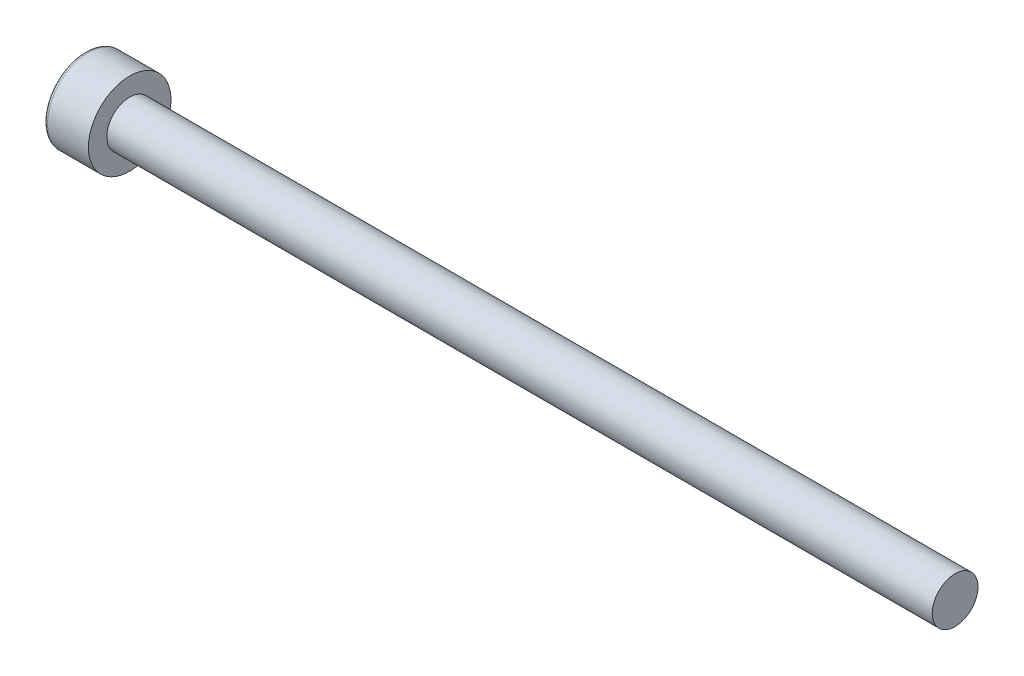
ISO-10303-21;
HEADER;
FILE_DESCRIPTION(('STEP AP214'),'2;1');
FILE_NAME('part.step','',(''),(''),'','','');
FILE_SCHEMA(('AUTOMOTIVE_DESIGN { 1 0 10303 214 1 1 1 1 }'));
ENDSEC;
DATA;
#1=APPLICATION_CONTEXT('core data for automotive mechanical design processes');
#2=APPLICATION_PROTOCOL_DEFINITION('international standard','automotive_design',2000,#1);
#3=PRODUCT_CONTEXT('',#1,'mechanical');
#4=PRODUCT('Part','Part','',(#3));
#5=PRODUCT_RELATED_PRODUCT_CATEGORY('part','',(#4));
#6=PRODUCT_DEFINITION_FORMATION('','',#4);
#7=PRODUCT_DEFINITION_CONTEXT('part definition',#1,'design');
#8=PRODUCT_DEFINITION('design','',#6,#7);
#9=PRODUCT_DEFINITION_SHAPE('','',#8);
#10=(LENGTH_UNIT() NAMED_UNIT(*) SI_UNIT(.MILLI.,.METRE.));
#11=(NAMED_UNIT(*) PLANE_ANGLE_UNIT() SI_UNIT($,.RADIAN.));
#12=(NAMED_UNIT(*) SI_UNIT($,.STERADIAN.) SOLID_ANGLE_UNIT());
#13=UNCERTAINTY_MEASURE_WITH_UNIT(LENGTH_MEASURE(1.E-05),#10,'distance_accuracy_value','');
#14=(GEOMETRIC_REPRESENTATION_CONTEXT(3) GLOBAL_UNCERTAINTY_ASSIGNED_CONTEXT((#13)) GLOBAL_UNIT_ASSIGNED_CONTEXT((#10,
#11,#12)) REPRESENTATION_CONTEXT('',''));
#15=CARTESIAN_POINT('',(0.,0.,0.));
#16=DIRECTION('',(0.,0.,1.));
#17=DIRECTION('',(1.,0.,0.));
#18=AXIS2_PLACEMENT_3D('',#15,#16,#17);
#19=CARTESIAN_POINT('',(0.,0.,0.));
#20=DIRECTION('',(1.,0.,0.));
#21=DIRECTION('',(0.,0.,-1.));
#22=AXIS2_PLACEMENT_3D('',#19,#20,#21);
#23=PLANE('',#22);
#24=CARTESIAN_POINT('',(0.,0.,0.));
#25=DIRECTION('',(1.,0.,0.));
#26=DIRECTION('',(0.,0.,-1.));
#27=AXIS2_PLACEMENT_3D('',#24,#25,#26);
#28=CIRCLE('',#27,2.05);
#29=CARTESIAN_POINT('',(0.,0.,-2.05));
#30=VERTEX_POINT('',#29);
#31=EDGE_CURVE('E47',#30,#30,#28,.F.);
#32=ORIENTED_EDGE('',*,*,#31,.T.);
#33=EDGE_LOOP('',(#32));
#34=FACE_BOUND('',#33,.T.);
#35=DIRECTION('',(0.,-0.866025403784439,0.5));
#36=VECTOR('',#35,1.);
#37=CARTESIAN_POINT('',(0.,0.,-1.15470053837925));
#38=LINE('',#37,#36);
#39=CARTESIAN_POINT('',(0.,0.,-1.15470053837925));
#40=VERTEX_POINT('',#39);
#41=CARTESIAN_POINT('',(0.,-1.,-0.577350269189626));
#42=VERTEX_POINT('',#41);
#43=EDGE_CURVE('E128',#40,#42,#38,.T.);
#44=ORIENTED_EDGE('',*,*,#43,.F.);
#45=DIRECTION('',(0.,-0.866025403784439,-0.5));
#46=VECTOR('',#45,1.);
#47=CARTESIAN_POINT('',(0.,1.,-0.577350269189626));
#48=LINE('',#47,#46);
#49=CARTESIAN_POINT('',(0.,1.,-0.577350269189626));
#50=VERTEX_POINT('',#49);
#51=EDGE_CURVE('E54',#50,#40,#48,.T.);
#52=ORIENTED_EDGE('',*,*,#51,.F.);
#53=DIRECTION('',(0.,0.,-1.));
#54=VECTOR('',#53,1.);
#55=CARTESIAN_POINT('',(0.,1.,0.577350269189626));
#56=LINE('',#55,#54);
#57=CARTESIAN_POINT('',(0.,1.,0.577350269189626));
#58=VERTEX_POINT('',#57);
#59=EDGE_CURVE('E137',#58,#50,#56,.T.);
#60=ORIENTED_EDGE('',*,*,#59,.F.);
#61=DIRECTION('',(0.,0.866025403784439,-0.5));
#62=VECTOR('',#61,1.);
#63=CARTESIAN_POINT('',(0.,0.,1.15470053837925));
#64=LINE('',#63,#62);
#65=CARTESIAN_POINT('',(0.,0.,1.15470053837925));
#66=VERTEX_POINT('',#65);
#67=EDGE_CURVE('E135',#66,#58,#64,.T.);
#68=ORIENTED_EDGE('',*,*,#67,.F.);
#69=DIRECTION('',(0.,0.866025403784438,0.5));
#70=VECTOR('',#69,1.);
#71=CARTESIAN_POINT('',(0.,-0.999999999999999,0.577350269189625));
#72=LINE('',#71,#70);
#73=CARTESIAN_POINT('',(0.,-0.999999999999999,0.577350269189625));
#74=VERTEX_POINT('',#73);
#75=EDGE_CURVE('E102',#74,#66,#72,.T.);
#76=ORIENTED_EDGE('',*,*,#75,.F.);
#77=DIRECTION('',(0.,0.,1.));
#78=VECTOR('',#77,1.);
#79=CARTESIAN_POINT('',(0.,-1.,-0.577350269189626));
#80=LINE('',#79,#78);
#81=EDGE_CURVE('E131',#42,#74,#80,.T.);
#82=ORIENTED_EDGE('',*,*,#81,.F.);
#83=EDGE_LOOP('',(#44,#52,#60,#68,#76,#82));
#84=FACE_BOUND('',#83,.T.);
#85=ADVANCED_FACE('F39',(#34,#84),#23,.F.);
#86=CARTESIAN_POINT('',(0.,0.,0.));
#87=DIRECTION('',(-1.,0.,0.));
#88=DIRECTION('',(0.,0.,1.));
#89=AXIS2_PLACEMENT_3D('',#86,#87,#88);
#90=CYLINDRICAL_SURFACE('',#89,2.25);
#91=CARTESIAN_POINT('',(0.2,0.,0.));
#92=DIRECTION('',(1.,0.,0.));
#93=DIRECTION('',(0.,0.,-1.));
#94=AXIS2_PLACEMENT_3D('',#91,#92,#93);
#95=CIRCLE('',#94,2.25);
#96=CARTESIAN_POINT('',(0.2,0.,-2.25));
#97=VERTEX_POINT('',#96);
#98=EDGE_CURVE('E11',#97,#97,#95,.T.);
#99=ORIENTED_EDGE('',*,*,#98,.T.);
#100=EDGE_LOOP('',(#99));
#101=FACE_BOUND('',#100,.T.);
#102=CARTESIAN_POINT('',(2.43,0.,0.));
#103=DIRECTION('',(-1.,0.,0.));
#104=DIRECTION('',(0.,0.,1.));
#105=AXIS2_PLACEMENT_3D('',#102,#103,#104);
#106=CIRCLE('',#105,2.25);
#107=CARTESIAN_POINT('',(2.43,0.,2.25));
#108=VERTEX_POINT('',#107);
#109=EDGE_CURVE('E152',#108,#108,#106,.T.);
#110=ORIENTED_EDGE('',*,*,#109,.T.);
#111=EDGE_LOOP('',(#110));
#112=FACE_BOUND('',#111,.T.);
#113=ADVANCED_FACE('F168',(#101,#112),#90,.T.);
#114=CARTESIAN_POINT('',(2.43,2.25,0.));
#115=DIRECTION('',(-1.,0.,0.));
#116=DIRECTION('',(0.,0.,1.));
#117=AXIS2_PLACEMENT_3D('',#114,#115,#116);
#118=PLANE('',#117);
#119=ORIENTED_EDGE('',*,*,#109,.F.);
#120=EDGE_LOOP('',(#119));
#121=FACE_BOUND('',#120,.T.);
#122=CARTESIAN_POINT('',(2.43,0.,0.));
#123=DIRECTION('',(-1.,0.,0.));
#124=DIRECTION('',(0.,0.,1.));
#125=AXIS2_PLACEMENT_3D('',#122,#123,#124);
#126=CIRCLE('',#125,1.25);
#127=CARTESIAN_POINT('',(2.43,0.,1.25));
#128=VERTEX_POINT('',#127);
#129=EDGE_CURVE('E149',#128,#128,#126,.T.);
#130=ORIENTED_EDGE('',*,*,#129,.T.);
#131=EDGE_LOOP('',(#130));
#132=FACE_BOUND('',#131,.T.);
#133=ADVANCED_FACE('F172',(#121,#132),#118,.F.);
#134=CARTESIAN_POINT('',(0.,0.,0.));
#135=DIRECTION('',(-1.,0.,0.));
#136=DIRECTION('',(0.,0.,1.));
#137=AXIS2_PLACEMENT_3D('',#134,#135,#136);
#138=CYLINDRICAL_SURFACE('',#137,1.25);
#139=ORIENTED_EDGE('',*,*,#129,.F.);
#140=EDGE_LOOP('',(#139));
#141=FACE_BOUND('',#140,.T.);
#142=CARTESIAN_POINT('',(47.43,0.,0.));
#143=DIRECTION('',(-1.,0.,0.));
#144=DIRECTION('',(0.,0.,1.));
#145=AXIS2_PLACEMENT_3D('',#142,#143,#144);
#146=CIRCLE('',#145,1.25);
#147=CARTESIAN_POINT('',(47.43,0.,1.25));
#148=VERTEX_POINT('',#147);
#149=EDGE_CURVE('E141',#148,#148,#146,.T.);
#150=ORIENTED_EDGE('',*,*,#149,.T.);
#151=EDGE_LOOP('',(#150));
#152=FACE_BOUND('',#151,.T.);
#153=ADVANCED_FACE('F178',(#141,#152),#138,.T.);
#154=CARTESIAN_POINT('',(47.43,1.25,0.));
#155=DIRECTION('',(-1.,0.,0.));
#156=DIRECTION('',(0.,0.,1.));
#157=AXIS2_PLACEMENT_3D('',#154,#155,#156);
#158=PLANE('',#157);
#159=ORIENTED_EDGE('',*,*,#149,.F.);
#160=EDGE_LOOP('',(#159));
#161=FACE_BOUND('',#160,.T.);
#162=ADVANCED_FACE('F182',(#161),#158,.F.);
#163=CARTESIAN_POINT('',(1.1,1.,-0.577350269189626));
#164=DIRECTION('',(0.,0.5,-0.866025403784438));
#165=DIRECTION('',(0.,0.866025403784439,0.5));
#166=AXIS2_PLACEMENT_3D('',#163,#164,#165);
#167=PLANE('',#166);
#168=ORIENTED_EDGE('',*,*,#51,.T.);
#169=DIRECTION('',(-1.,0.,0.));
#170=VECTOR('',#169,1.);
#171=CARTESIAN_POINT('',(1.1,0.,-1.15470053837925));
#172=LINE('',#171,#170);
#173=CARTESIAN_POINT('',(1.1,0.,-1.15470053837925));
#174=VERTEX_POINT('',#173);
#175=EDGE_CURVE('E84',#174,#40,#172,.T.);
#176=ORIENTED_EDGE('',*,*,#175,.F.);
#177=DIRECTION('',(0.,-0.866025403784439,-0.5));
#178=VECTOR('',#177,1.);
#179=CARTESIAN_POINT('',(1.1,1.,-0.577350269189626));
#180=LINE('',#179,#178);
#181=CARTESIAN_POINT('',(1.1,1.,-0.577350269189626));
#182=VERTEX_POINT('',#181);
#183=EDGE_CURVE('E139',#182,#174,#180,.T.);
#184=ORIENTED_EDGE('',*,*,#183,.F.);
#185=DIRECTION('',(-1.,0.,0.));
#186=VECTOR('',#185,1.);
#187=CARTESIAN_POINT('',(1.1,1.,-0.577350269189626));
#188=LINE('',#187,#186);
#189=EDGE_CURVE('E62',#182,#50,#188,.T.);
#190=ORIENTED_EDGE('',*,*,#189,.T.);
#191=EDGE_LOOP('',(#168,#176,#184,#190));
#192=FACE_BOUND('',#191,.T.);
#193=ADVANCED_FACE('F186',(#192),#167,.F.);
#194=CARTESIAN_POINT('',(1.1,1.,0.577350269189626));
#195=DIRECTION('',(0.,1.,0.));
#196=DIRECTION('',(0.,0.,1.));
#197=AXIS2_PLACEMENT_3D('',#194,#195,#196);
#198=PLANE('',#197);
#199=ORIENTED_EDGE('',*,*,#59,.T.);
#200=ORIENTED_EDGE('',*,*,#189,.F.);
#201=DIRECTION('',(0.,0.,-1.));
#202=VECTOR('',#201,1.);
#203=CARTESIAN_POINT('',(1.1,1.,0.577350269189626));
#204=LINE('',#203,#202);
#205=CARTESIAN_POINT('',(1.1,1.,0.577350269189626));
#206=VERTEX_POINT('',#205);
#207=EDGE_CURVE('E114',#206,#182,#204,.T.);
#208=ORIENTED_EDGE('',*,*,#207,.F.);
#209=DIRECTION('',(-1.,0.,0.));
#210=VECTOR('',#209,1.);
#211=CARTESIAN_POINT('',(1.1,1.,0.577350269189626));
#212=LINE('',#211,#210);
#213=EDGE_CURVE('E106',#206,#58,#212,.T.);
#214=ORIENTED_EDGE('',*,*,#213,.T.);
#215=EDGE_LOOP('',(#199,#200,#208,#214));
#216=FACE_BOUND('',#215,.T.);
#217=ADVANCED_FACE('F190',(#216),#198,.F.);
#218=CARTESIAN_POINT('',(1.1,0.,1.15470053837925));
#219=DIRECTION('',(0.,0.5,0.866025403784439));
#220=DIRECTION('',(0.,-0.866025403784439,0.5));
#221=AXIS2_PLACEMENT_3D('',#218,#219,#220);
#222=PLANE('',#221);
#223=ORIENTED_EDGE('',*,*,#67,.T.);
#224=ORIENTED_EDGE('',*,*,#213,.F.);
#225=DIRECTION('',(0.,0.866025403784439,-0.5));
#226=VECTOR('',#225,1.);
#227=CARTESIAN_POINT('',(1.1,0.,1.15470053837925));
#228=LINE('',#227,#226);
#229=CARTESIAN_POINT('',(1.1,0.,1.15470053837925));
#230=VERTEX_POINT('',#229);
#231=EDGE_CURVE('E110',#230,#206,#228,.T.);
#232=ORIENTED_EDGE('',*,*,#231,.F.);
#233=DIRECTION('',(-1.,0.,0.));
#234=VECTOR('',#233,1.);
#235=CARTESIAN_POINT('',(1.1,0.,1.15470053837925));
#236=LINE('',#235,#234);
#237=EDGE_CURVE('E95',#230,#66,#236,.T.);
#238=ORIENTED_EDGE('',*,*,#237,.T.);
#239=EDGE_LOOP('',(#223,#224,#232,#238));
#240=FACE_BOUND('',#239,.T.);
#241=ADVANCED_FACE('F111',(#240),#222,.F.);
#242=CARTESIAN_POINT('',(1.1,-0.999999999999999,0.577350269189625));
#243=DIRECTION('',(0.,-0.5,0.866025403784439));
#244=DIRECTION('',(0.,-0.866025403784438,-0.5));
#245=AXIS2_PLACEMENT_3D('',#242,#243,#244);
#246=PLANE('',#245);
#247=ORIENTED_EDGE('',*,*,#75,.T.);
#248=ORIENTED_EDGE('',*,*,#237,.F.);
#249=DIRECTION('',(0.,0.866025403784438,0.5));
#250=VECTOR('',#249,1.);
#251=CARTESIAN_POINT('',(1.1,-0.999999999999999,0.577350269189625));
#252=LINE('',#251,#250);
#253=CARTESIAN_POINT('',(1.1,-0.999999999999999,0.577350269189625));
#254=VERTEX_POINT('',#253);
#255=EDGE_CURVE('E99',#254,#230,#252,.T.);
#256=ORIENTED_EDGE('',*,*,#255,.F.);
#257=DIRECTION('',(-1.,0.,0.));
#258=VECTOR('',#257,1.);
#259=CARTESIAN_POINT('',(1.1,-0.999999999999999,0.577350269189625));
#260=LINE('',#259,#258);
#261=EDGE_CURVE('E107',#254,#74,#260,.T.);
#262=ORIENTED_EDGE('',*,*,#261,.T.);
#263=EDGE_LOOP('',(#247,#248,#256,#262));
#264=FACE_BOUND('',#263,.T.);
#265=ADVANCED_FACE('F97',(#264),#246,.F.);
#266=CARTESIAN_POINT('',(1.1,-1.,-0.577350269189626));
#267=DIRECTION('',(0.,-1.,0.));
#268=DIRECTION('',(0.,0.,-1.));
#269=AXIS2_PLACEMENT_3D('',#266,#267,#268);
#270=PLANE('',#269);
#271=ORIENTED_EDGE('',*,*,#81,.T.);
#272=ORIENTED_EDGE('',*,*,#261,.F.);
#273=DIRECTION('',(0.,0.,1.));
#274=VECTOR('',#273,1.);
#275=CARTESIAN_POINT('',(1.1,-1.,-0.577350269189626));
#276=LINE('',#275,#274);
#277=CARTESIAN_POINT('',(1.1,-1.,-0.577350269189626));
#278=VERTEX_POINT('',#277);
#279=EDGE_CURVE('E120',#278,#254,#276,.T.);
#280=ORIENTED_EDGE('',*,*,#279,.F.);
#281=DIRECTION('',(-1.,0.,0.));
#282=VECTOR('',#281,1.);
#283=CARTESIAN_POINT('',(1.1,-1.,-0.577350269189626));
#284=LINE('',#283,#282);
#285=EDGE_CURVE('E144',#278,#42,#284,.T.);
#286=ORIENTED_EDGE('',*,*,#285,.T.);
#287=EDGE_LOOP('',(#271,#272,#280,#286));
#288=FACE_BOUND('',#287,.T.);
#289=ADVANCED_FACE('F193',(#288),#270,.F.);
#290=CARTESIAN_POINT('',(1.1,0.,-1.15470053837925));
#291=DIRECTION('',(0.,-0.5,-0.866025403784439));
#292=DIRECTION('',(0.,0.866025403784439,-0.5));
#293=AXIS2_PLACEMENT_3D('',#290,#291,#292);
#294=PLANE('',#293);
#295=ORIENTED_EDGE('',*,*,#43,.T.);
#296=ORIENTED_EDGE('',*,*,#285,.F.);
#297=DIRECTION('',(0.,-0.866025403784439,0.5));
#298=VECTOR('',#297,1.);
#299=CARTESIAN_POINT('',(1.1,0.,-1.15470053837925));
#300=LINE('',#299,#298);
#301=EDGE_CURVE('E122',#174,#278,#300,.T.);
#302=ORIENTED_EDGE('',*,*,#301,.F.);
#303=ORIENTED_EDGE('',*,*,#175,.T.);
#304=EDGE_LOOP('',(#295,#296,#302,#303));
#305=FACE_BOUND('',#304,.T.);
#306=ADVANCED_FACE('F164',(#305),#294,.F.);
#307=CARTESIAN_POINT('',(1.1,0.,0.));
#308=DIRECTION('',(-1.,0.,0.));
#309=DIRECTION('',(0.,0.,1.));
#310=AXIS2_PLACEMENT_3D('',#307,#308,#309);
#311=PLANE('',#310);
#312=ORIENTED_EDGE('',*,*,#183,.T.);
#313=ORIENTED_EDGE('',*,*,#301,.T.);
#314=ORIENTED_EDGE('',*,*,#279,.T.);
#315=ORIENTED_EDGE('',*,*,#255,.T.);
#316=ORIENTED_EDGE('',*,*,#231,.T.);
#317=ORIENTED_EDGE('',*,*,#207,.T.);
#318=EDGE_LOOP('',(#312,#313,#314,#315,#316,#317));
#319=FACE_BOUND('',#318,.T.);
#320=ADVANCED_FACE('F117',(#319),#311,.T.);
#321=CARTESIAN_POINT('',(0.2,0.,0.));
#322=DIRECTION('',(1.,0.,0.));
#323=DIRECTION('',(0.,0.,-1.));
#324=AXIS2_PLACEMENT_3D('',#321,#322,#323);
#325=TOROIDAL_SURFACE('',#324,2.05,0.2);
#326=ORIENTED_EDGE('',*,*,#98,.F.);
#327=EDGE_LOOP('',(#326));
#328=FACE_BOUND('',#327,.T.);
#329=ORIENTED_EDGE('',*,*,#31,.F.);
#330=EDGE_LOOP('',(#329));
#331=FACE_BOUND('',#330,.T.);
#332=ADVANCED_FACE('F41',(#328,#331),#325,.T.);
#333=CLOSED_SHELL('',(#85,#113,#133,#153,#162,#193,#217,#241,#265,#289,#306,#320,#332));
#334=MANIFOLD_SOLID_BREP('B2',#333);
#335=ADVANCED_BREP_SHAPE_REPRESENTATION('',(#18,#334),#14);
#336=SHAPE_DEFINITION_REPRESENTATION(#9,#335);
ENDSEC;
END-ISO-10303-21;
